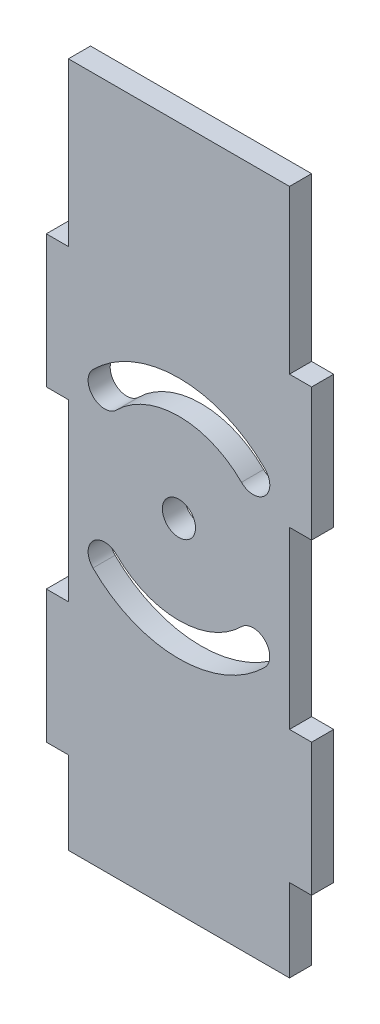
ISO-10303-21;
HEADER;
FILE_DESCRIPTION(('STEP AP214'),'2;1');
FILE_NAME('part.step','',(''),(''),'','','');
FILE_SCHEMA(('AUTOMOTIVE_DESIGN { 1 0 10303 214 1 1 1 1 }'));
ENDSEC;
DATA;
#1=APPLICATION_CONTEXT('core data for automotive mechanical design processes');
#2=APPLICATION_PROTOCOL_DEFINITION('international standard','automotive_design',2000,#1);
#3=PRODUCT_CONTEXT('',#1,'mechanical');
#4=PRODUCT('Part','Part','',(#3));
#5=PRODUCT_RELATED_PRODUCT_CATEGORY('part','',(#4));
#6=PRODUCT_DEFINITION_FORMATION('','',#4);
#7=PRODUCT_DEFINITION_CONTEXT('part definition',#1,'design');
#8=PRODUCT_DEFINITION('design','',#6,#7);
#9=PRODUCT_DEFINITION_SHAPE('','',#8);
#10=(LENGTH_UNIT() NAMED_UNIT(*) SI_UNIT(.MILLI.,.METRE.));
#11=(NAMED_UNIT(*) PLANE_ANGLE_UNIT() SI_UNIT($,.RADIAN.));
#12=(NAMED_UNIT(*) SI_UNIT($,.STERADIAN.) SOLID_ANGLE_UNIT());
#13=UNCERTAINTY_MEASURE_WITH_UNIT(LENGTH_MEASURE(1.E-05),#10,'distance_accuracy_value','');
#14=(GEOMETRIC_REPRESENTATION_CONTEXT(3) GLOBAL_UNCERTAINTY_ASSIGNED_CONTEXT((#13)) GLOBAL_UNIT_ASSIGNED_CONTEXT((#10,
#11,#12)) REPRESENTATION_CONTEXT('',''));
#15=CARTESIAN_POINT('',(0.,0.,0.));
#16=DIRECTION('',(0.,0.,1.));
#17=DIRECTION('',(1.,0.,0.));
#18=AXIS2_PLACEMENT_3D('',#15,#16,#17);
#19=CARTESIAN_POINT('',(0.,0.,3.175));
#20=DIRECTION('',(0.,0.,-1.));
#21=DIRECTION('',(-1.,0.,0.));
#22=AXIS2_PLACEMENT_3D('',#19,#20,#21);
#23=PLANE('',#22);
#24=CARTESIAN_POINT('',(-19.05,316.548657531254,3.175));
#25=DIRECTION('',(0.,0.,1.));
#26=DIRECTION('',(1.,0.,0.));
#27=AXIS2_PLACEMENT_3D('',#24,#25,#26);
#28=CIRCLE('',#27,2.38125000000001);
#29=CARTESIAN_POINT('',(-16.66875,316.548657531254,3.175));
#30=VERTEX_POINT('',#29);
#31=EDGE_CURVE('E242',#30,#30,#28,.T.);
#32=ORIENTED_EDGE('',*,*,#31,.F.);
#33=EDGE_LOOP('',(#32));
#34=FACE_BOUND('',#33,.T.);
#35=CARTESIAN_POINT('',(-19.05,316.548657531254,3.175));
#36=DIRECTION('',(0.,0.,1.));
#37=DIRECTION('',(1.,0.,0.));
#38=AXIS2_PLACEMENT_3D('',#35,#36,#37);
#39=CIRCLE('',#38,12.7);
#40=CARTESIAN_POINT('',(-28.0302561210692,307.568401410185,3.175));
#41=VERTEX_POINT('',#40);
#42=CARTESIAN_POINT('',(-10.0697438789309,307.568401410185,3.175));
#43=VERTEX_POINT('',#42);
#44=EDGE_CURVE('E255',#41,#43,#39,.T.);
#45=ORIENTED_EDGE('',*,*,#44,.T.);
#46=CARTESIAN_POINT('',(-8.38594585623039,305.884603387485,3.175));
#47=DIRECTION('',(0.,0.,1.));
#48=DIRECTION('',(1.,0.,0.));
#49=AXIS2_PLACEMENT_3D('',#46,#47,#48);
#50=CIRCLE('',#49,2.38125);
#51=CARTESIAN_POINT('',(-6.70214783352994,304.200805364784,3.175));
#52=VERTEX_POINT('',#51);
#53=EDGE_CURVE('E262',#52,#43,#50,.T.);
#54=ORIENTED_EDGE('',*,*,#53,.F.);
#55=CARTESIAN_POINT('',(-19.05,316.548657531254,3.175));
#56=DIRECTION('',(0.,0.,1.));
#57=DIRECTION('',(1.,0.,0.));
#58=AXIS2_PLACEMENT_3D('',#55,#56,#57);
#59=CIRCLE('',#58,17.4625);
#60=CARTESIAN_POINT('',(-31.3978521664701,304.200805364784,3.175));
#61=VERTEX_POINT('',#60);
#62=EDGE_CURVE('E277',#61,#52,#59,.T.);
#63=ORIENTED_EDGE('',*,*,#62,.F.);
#64=CARTESIAN_POINT('',(-29.7140541437696,305.884603387485,3.175));
#65=DIRECTION('',(0.,0.,1.));
#66=DIRECTION('',(1.,0.,0.));
#67=AXIS2_PLACEMENT_3D('',#64,#65,#66);
#68=CIRCLE('',#67,2.38125);
#69=EDGE_CURVE('E274',#41,#61,#68,.T.);
#70=ORIENTED_EDGE('',*,*,#69,.F.);
#71=EDGE_LOOP('',(#45,#54,#63,#70));
#72=FACE_BOUND('',#71,.T.);
#73=DIRECTION('',(0.,-1.,0.));
#74=VECTOR('',#73,1.);
#75=CARTESIAN_POINT('',(-3.17500000000003,365.778475051382,3.175));
#76=LINE('',#75,#74);
#77=CARTESIAN_POINT('',(-3.17500000000003,365.778475051382,3.175));
#78=VERTEX_POINT('',#77);
#79=CARTESIAN_POINT('',(-3.17500000000003,342.42138650204,3.175));
#80=VERTEX_POINT('',#79);
#81=EDGE_CURVE('E291',#78,#80,#76,.T.);
#82=ORIENTED_EDGE('',*,*,#81,.F.);
#83=DIRECTION('',(-1.,0.,0.));
#84=VECTOR('',#83,1.);
#85=CARTESIAN_POINT('',(-3.17500000000003,365.778475051382,3.175));
#86=LINE('',#85,#84);
#87=CARTESIAN_POINT('',(-34.925,365.778475051382,3.175));
#88=VERTEX_POINT('',#87);
#89=EDGE_CURVE('E340',#78,#88,#86,.T.);
#90=ORIENTED_EDGE('',*,*,#89,.T.);
#91=DIRECTION('',(0.,-1.,0.));
#92=VECTOR('',#91,1.);
#93=CARTESIAN_POINT('',(-34.925,365.778475051382,3.175));
#94=LINE('',#93,#92);
#95=CARTESIAN_POINT('',(-34.925,342.42138650204,3.175));
#96=VERTEX_POINT('',#95);
#97=EDGE_CURVE('E338',#88,#96,#94,.T.);
#98=ORIENTED_EDGE('',*,*,#97,.T.);
#99=DIRECTION('',(1.,0.,0.));
#100=VECTOR('',#99,1.);
#101=CARTESIAN_POINT('',(-38.1,342.42138650204,3.175));
#102=LINE('',#101,#100);
#103=CARTESIAN_POINT('',(-38.1,342.42138650204,3.175));
#104=VERTEX_POINT('',#103);
#105=EDGE_CURVE('E335',#104,#96,#102,.T.);
#106=ORIENTED_EDGE('',*,*,#105,.F.);
#107=DIRECTION('',(0.,-1.,0.));
#108=VECTOR('',#107,1.);
#109=CARTESIAN_POINT('',(-38.1,342.42138650204,3.175));
#110=LINE('',#109,#108);
#111=CARTESIAN_POINT('',(-38.1,323.37138650204,3.175));
#112=VERTEX_POINT('',#111);
#113=EDGE_CURVE('E333',#104,#112,#110,.T.);
#114=ORIENTED_EDGE('',*,*,#113,.T.);
#115=DIRECTION('',(1.,0.,0.));
#116=VECTOR('',#115,1.);
#117=CARTESIAN_POINT('',(-38.1,323.37138650204,3.175));
#118=LINE('',#117,#116);
#119=CARTESIAN_POINT('',(-34.925,323.37138650204,3.175));
#120=VERTEX_POINT('',#119);
#121=EDGE_CURVE('E331',#112,#120,#118,.T.);
#122=ORIENTED_EDGE('',*,*,#121,.T.);
#123=DIRECTION('',(0.,-1.,0.));
#124=VECTOR('',#123,1.);
#125=CARTESIAN_POINT('',(-34.925,323.37138650204,3.175));
#126=LINE('',#125,#124);
#127=CARTESIAN_POINT('',(-34.925,298.240631324578,3.175));
#128=VERTEX_POINT('',#127);
#129=EDGE_CURVE('E329',#120,#128,#126,.T.);
#130=ORIENTED_EDGE('',*,*,#129,.T.);
#131=DIRECTION('',(1.,0.,0.));
#132=VECTOR('',#131,1.);
#133=CARTESIAN_POINT('',(-38.1,298.240631324578,3.175));
#134=LINE('',#133,#132);
#135=CARTESIAN_POINT('',(-38.1,298.240631324578,3.175));
#136=VERTEX_POINT('',#135);
#137=EDGE_CURVE('E326',#136,#128,#134,.T.);
#138=ORIENTED_EDGE('',*,*,#137,.F.);
#139=DIRECTION('',(0.,-1.,0.));
#140=VECTOR('',#139,1.);
#141=CARTESIAN_POINT('',(-38.1,298.240631324578,3.175));
#142=LINE('',#141,#140);
#143=CARTESIAN_POINT('',(-38.1,279.190631324578,3.175));
#144=VERTEX_POINT('',#143);
#145=EDGE_CURVE('E324',#136,#144,#142,.T.);
#146=ORIENTED_EDGE('',*,*,#145,.T.);
#147=DIRECTION('',(1.,0.,0.));
#148=VECTOR('',#147,1.);
#149=CARTESIAN_POINT('',(-38.1,279.190631324578,3.175));
#150=LINE('',#149,#148);
#151=CARTESIAN_POINT('',(-34.925,279.190631324578,3.175));
#152=VERTEX_POINT('',#151);
#153=EDGE_CURVE('E322',#144,#152,#150,.T.);
#154=ORIENTED_EDGE('',*,*,#153,.T.);
#155=DIRECTION('',(0.,-1.,0.));
#156=VECTOR('',#155,1.);
#157=CARTESIAN_POINT('',(-34.925,279.190631324578,3.175));
#158=LINE('',#157,#156);
#159=CARTESIAN_POINT('',(-34.925,267.318840011126,3.175));
#160=VERTEX_POINT('',#159);
#161=EDGE_CURVE('E320',#152,#160,#158,.T.);
#162=ORIENTED_EDGE('',*,*,#161,.T.);
#163=DIRECTION('',(-1.,0.,0.));
#164=VECTOR('',#163,1.);
#165=CARTESIAN_POINT('',(-3.17500000000003,267.318840011126,3.175));
#166=LINE('',#165,#164);
#167=CARTESIAN_POINT('',(-3.17500000000003,267.318840011126,3.175));
#168=VERTEX_POINT('',#167);
#169=EDGE_CURVE('E317',#168,#160,#166,.T.);
#170=ORIENTED_EDGE('',*,*,#169,.F.);
#171=DIRECTION('',(0.,-1.,0.));
#172=VECTOR('',#171,1.);
#173=CARTESIAN_POINT('',(-3.17500000000003,279.190631324578,3.175));
#174=LINE('',#173,#172);
#175=CARTESIAN_POINT('',(-3.17500000000003,279.190631324578,3.175));
#176=VERTEX_POINT('',#175);
#177=EDGE_CURVE('E314',#176,#168,#174,.T.);
#178=ORIENTED_EDGE('',*,*,#177,.F.);
#179=DIRECTION('',(-1.,0.,0.));
#180=VECTOR('',#179,1.);
#181=CARTESIAN_POINT('',(0.,279.190631324578,3.175));
#182=LINE('',#181,#180);
#183=CARTESIAN_POINT('',(0.,279.190631324578,3.175));
#184=VERTEX_POINT('',#183);
#185=EDGE_CURVE('E311',#184,#176,#182,.T.);
#186=ORIENTED_EDGE('',*,*,#185,.F.);
#187=DIRECTION('',(0.,-1.,0.));
#188=VECTOR('',#187,1.);
#189=CARTESIAN_POINT('',(0.,298.240631324578,3.175));
#190=LINE('',#189,#188);
#191=CARTESIAN_POINT('',(0.,298.240631324578,3.175));
#192=VERTEX_POINT('',#191);
#193=EDGE_CURVE('E308',#192,#184,#190,.T.);
#194=ORIENTED_EDGE('',*,*,#193,.F.);
#195=DIRECTION('',(-1.,0.,0.));
#196=VECTOR('',#195,1.);
#197=CARTESIAN_POINT('',(0.,298.240631324578,3.175));
#198=LINE('',#197,#196);
#199=CARTESIAN_POINT('',(-3.17500000000003,298.240631324578,3.175));
#200=VERTEX_POINT('',#199);
#201=EDGE_CURVE('E306',#192,#200,#198,.T.);
#202=ORIENTED_EDGE('',*,*,#201,.T.);
#203=DIRECTION('',(0.,-1.,0.));
#204=VECTOR('',#203,1.);
#205=CARTESIAN_POINT('',(-3.17500000000003,323.37138650204,3.175));
#206=LINE('',#205,#204);
#207=CARTESIAN_POINT('',(-3.17500000000003,323.37138650204,3.175));
#208=VERTEX_POINT('',#207);
#209=EDGE_CURVE('E303',#208,#200,#206,.T.);
#210=ORIENTED_EDGE('',*,*,#209,.F.);
#211=DIRECTION('',(-1.,0.,0.));
#212=VECTOR('',#211,1.);
#213=CARTESIAN_POINT('',(0.,323.37138650204,3.175));
#214=LINE('',#213,#212);
#215=CARTESIAN_POINT('',(0.,323.37138650204,3.175));
#216=VERTEX_POINT('',#215);
#217=EDGE_CURVE('E300',#216,#208,#214,.T.);
#218=ORIENTED_EDGE('',*,*,#217,.F.);
#219=DIRECTION('',(0.,-1.,0.));
#220=VECTOR('',#219,1.);
#221=CARTESIAN_POINT('',(0.,342.42138650204,3.175));
#222=LINE('',#221,#220);
#223=CARTESIAN_POINT('',(0.,342.42138650204,3.175));
#224=VERTEX_POINT('',#223);
#225=EDGE_CURVE('E297',#224,#216,#222,.T.);
#226=ORIENTED_EDGE('',*,*,#225,.F.);
#227=DIRECTION('',(-1.,0.,0.));
#228=VECTOR('',#227,1.);
#229=CARTESIAN_POINT('',(0.,342.42138650204,3.175));
#230=LINE('',#229,#228);
#231=EDGE_CURVE('E294',#224,#80,#230,.T.);
#232=ORIENTED_EDGE('',*,*,#231,.T.);
#233=EDGE_LOOP('',(#82,#90,#98,#106,#114,#122,#130,#138,#146,#154,#162,#170,#178,#186,#194,#202,
#210,#218,#226,#232));
#234=FACE_BOUND('',#233,.T.);
#235=CARTESIAN_POINT('',(-19.05,316.548657531254,3.175));
#236=DIRECTION('',(0.,0.,1.));
#237=DIRECTION('',(1.,0.,0.));
#238=AXIS2_PLACEMENT_3D('',#235,#236,#237);
#239=CIRCLE('',#238,12.7024091767679);
#240=CARTESIAN_POINT('',(-10.0680403337012,325.530617197553,3.175));
#241=VERTEX_POINT('',#240);
#242=CARTESIAN_POINT('',(-28.0319596662989,325.530617197553,3.175));
#243=VERTEX_POINT('',#242);
#244=EDGE_CURVE('E50',#241,#243,#239,.T.);
#245=ORIENTED_EDGE('',*,*,#244,.T.);
#246=CARTESIAN_POINT('',(-29.7157576889994,327.214415220254,3.175));
#247=DIRECTION('',(0.,0.,1.));
#248=DIRECTION('',(1.,0.,0.));
#249=AXIS2_PLACEMENT_3D('',#246,#247,#248);
#250=CIRCLE('',#249,2.38125000000002);
#251=CARTESIAN_POINT('',(-31.3995557116998,328.898213242954,3.175));
#252=VERTEX_POINT('',#251);
#253=EDGE_CURVE('E236',#252,#243,#250,.T.);
#254=ORIENTED_EDGE('',*,*,#253,.F.);
#255=CARTESIAN_POINT('',(-19.05,316.548657531254,3.175));
#256=DIRECTION('',(0.,0.,1.));
#257=DIRECTION('',(1.,0.,0.));
#258=AXIS2_PLACEMENT_3D('',#255,#256,#257);
#259=CIRCLE('',#258,17.464909176768);
#260=CARTESIAN_POINT('',(-6.70044428830035,328.898213242954,3.175));
#261=VERTEX_POINT('',#260);
#262=EDGE_CURVE('E239',#261,#252,#259,.T.);
#263=ORIENTED_EDGE('',*,*,#262,.F.);
#264=CARTESIAN_POINT('',(-8.38424231100077,327.214415220254,3.175));
#265=DIRECTION('',(0.,0.,1.));
#266=DIRECTION('',(1.,0.,0.));
#267=AXIS2_PLACEMENT_3D('',#264,#265,#266);
#268=CIRCLE('',#267,2.38124999999999);
#269=EDGE_CURVE('E248',#241,#261,#268,.T.);
#270=ORIENTED_EDGE('',*,*,#269,.F.);
#271=EDGE_LOOP('',(#245,#254,#263,#270));
#272=FACE_BOUND('',#271,.T.);
#273=ADVANCED_FACE('F33',(#34,#72,#234,#272),#23,.F.);
#274=CARTESIAN_POINT('',(0.,0.,0.));
#275=DIRECTION('',(0.,0.,-1.));
#276=DIRECTION('',(-1.,0.,0.));
#277=AXIS2_PLACEMENT_3D('',#274,#275,#276);
#278=PLANE('',#277);
#279=CARTESIAN_POINT('',(-19.05,316.548657531254,0.));
#280=DIRECTION('',(0.,0.,1.));
#281=DIRECTION('',(1.,0.,0.));
#282=AXIS2_PLACEMENT_3D('',#279,#280,#281);
#283=CIRCLE('',#282,2.38125000000001);
#284=CARTESIAN_POINT('',(-16.66875,316.548657531254,0.));
#285=VERTEX_POINT('',#284);
#286=EDGE_CURVE('E249',#285,#285,#283,.T.);
#287=ORIENTED_EDGE('',*,*,#286,.T.);
#288=EDGE_LOOP('',(#287));
#289=FACE_BOUND('',#288,.T.);
#290=DIRECTION('',(0.,-1.,0.));
#291=VECTOR('',#290,1.);
#292=CARTESIAN_POINT('',(-3.17500000000003,365.778475051382,0.));
#293=LINE('',#292,#291);
#294=CARTESIAN_POINT('',(-3.17500000000003,365.778475051382,0.));
#295=VERTEX_POINT('',#294);
#296=CARTESIAN_POINT('',(-3.17500000000003,342.42138650204,0.));
#297=VERTEX_POINT('',#296);
#298=EDGE_CURVE('E284',#295,#297,#293,.T.);
#299=ORIENTED_EDGE('',*,*,#298,.T.);
#300=DIRECTION('',(-1.,0.,0.));
#301=VECTOR('',#300,1.);
#302=CARTESIAN_POINT('',(0.,342.42138650204,0.));
#303=LINE('',#302,#301);
#304=CARTESIAN_POINT('',(0.,342.42138650204,0.));
#305=VERTEX_POINT('',#304);
#306=EDGE_CURVE('E344',#305,#297,#303,.T.);
#307=ORIENTED_EDGE('',*,*,#306,.F.);
#308=DIRECTION('',(0.,-1.,0.));
#309=VECTOR('',#308,1.);
#310=CARTESIAN_POINT('',(0.,342.42138650204,0.));
#311=LINE('',#310,#309);
#312=CARTESIAN_POINT('',(0.,323.37138650204,0.));
#313=VERTEX_POINT('',#312);
#314=EDGE_CURVE('E347',#305,#313,#311,.T.);
#315=ORIENTED_EDGE('',*,*,#314,.T.);
#316=DIRECTION('',(-1.,0.,0.));
#317=VECTOR('',#316,1.);
#318=CARTESIAN_POINT('',(0.,323.37138650204,0.));
#319=LINE('',#318,#317);
#320=CARTESIAN_POINT('',(-3.17500000000003,323.37138650204,0.));
#321=VERTEX_POINT('',#320);
#322=EDGE_CURVE('E350',#313,#321,#319,.T.);
#323=ORIENTED_EDGE('',*,*,#322,.T.);
#324=DIRECTION('',(0.,-1.,0.));
#325=VECTOR('',#324,1.);
#326=CARTESIAN_POINT('',(-3.17500000000003,323.37138650204,0.));
#327=LINE('',#326,#325);
#328=CARTESIAN_POINT('',(-3.17500000000003,298.240631324578,0.));
#329=VERTEX_POINT('',#328);
#330=EDGE_CURVE('E353',#321,#329,#327,.T.);
#331=ORIENTED_EDGE('',*,*,#330,.T.);
#332=DIRECTION('',(-1.,0.,0.));
#333=VECTOR('',#332,1.);
#334=CARTESIAN_POINT('',(0.,298.240631324578,0.));
#335=LINE('',#334,#333);
#336=CARTESIAN_POINT('',(0.,298.240631324578,0.));
#337=VERTEX_POINT('',#336);
#338=EDGE_CURVE('E356',#337,#329,#335,.T.);
#339=ORIENTED_EDGE('',*,*,#338,.F.);
#340=DIRECTION('',(0.,-1.,0.));
#341=VECTOR('',#340,1.);
#342=CARTESIAN_POINT('',(0.,298.240631324578,0.));
#343=LINE('',#342,#341);
#344=CARTESIAN_POINT('',(0.,279.190631324578,0.));
#345=VERTEX_POINT('',#344);
#346=EDGE_CURVE('E359',#337,#345,#343,.T.);
#347=ORIENTED_EDGE('',*,*,#346,.T.);
#348=DIRECTION('',(-1.,0.,0.));
#349=VECTOR('',#348,1.);
#350=CARTESIAN_POINT('',(0.,279.190631324578,0.));
#351=LINE('',#350,#349);
#352=CARTESIAN_POINT('',(-3.17500000000003,279.190631324578,0.));
#353=VERTEX_POINT('',#352);
#354=EDGE_CURVE('E362',#345,#353,#351,.T.);
#355=ORIENTED_EDGE('',*,*,#354,.T.);
#356=DIRECTION('',(0.,-1.,0.));
#357=VECTOR('',#356,1.);
#358=CARTESIAN_POINT('',(-3.17500000000003,279.190631324578,0.));
#359=LINE('',#358,#357);
#360=CARTESIAN_POINT('',(-3.17500000000003,267.318840011126,0.));
#361=VERTEX_POINT('',#360);
#362=EDGE_CURVE('E365',#353,#361,#359,.T.);
#363=ORIENTED_EDGE('',*,*,#362,.T.);
#364=DIRECTION('',(-1.,0.,0.));
#365=VECTOR('',#364,1.);
#366=CARTESIAN_POINT('',(-3.17500000000003,267.318840011126,0.));
#367=LINE('',#366,#365);
#368=CARTESIAN_POINT('',(-34.925,267.318840011126,0.));
#369=VERTEX_POINT('',#368);
#370=EDGE_CURVE('E368',#361,#369,#367,.T.);
#371=ORIENTED_EDGE('',*,*,#370,.T.);
#372=DIRECTION('',(0.,-1.,0.));
#373=VECTOR('',#372,1.);
#374=CARTESIAN_POINT('',(-34.925,279.190631324578,0.));
#375=LINE('',#374,#373);
#376=CARTESIAN_POINT('',(-34.925,279.190631324578,0.));
#377=VERTEX_POINT('',#376);
#378=EDGE_CURVE('E371',#377,#369,#375,.T.);
#379=ORIENTED_EDGE('',*,*,#378,.F.);
#380=DIRECTION('',(1.,0.,0.));
#381=VECTOR('',#380,1.);
#382=CARTESIAN_POINT('',(-38.1,279.190631324578,0.));
#383=LINE('',#382,#381);
#384=CARTESIAN_POINT('',(-38.1,279.190631324578,0.));
#385=VERTEX_POINT('',#384);
#386=EDGE_CURVE('E374',#385,#377,#383,.T.);
#387=ORIENTED_EDGE('',*,*,#386,.F.);
#388=DIRECTION('',(0.,-1.,0.));
#389=VECTOR('',#388,1.);
#390=CARTESIAN_POINT('',(-38.1,298.240631324578,0.));
#391=LINE('',#390,#389);
#392=CARTESIAN_POINT('',(-38.1,298.240631324578,0.));
#393=VERTEX_POINT('',#392);
#394=EDGE_CURVE('E376',#393,#385,#391,.T.);
#395=ORIENTED_EDGE('',*,*,#394,.F.);
#396=DIRECTION('',(1.,0.,0.));
#397=VECTOR('',#396,1.);
#398=CARTESIAN_POINT('',(-38.1,298.240631324578,0.));
#399=LINE('',#398,#397);
#400=CARTESIAN_POINT('',(-34.925,298.240631324578,0.));
#401=VERTEX_POINT('',#400);
#402=EDGE_CURVE('E378',#393,#401,#399,.T.);
#403=ORIENTED_EDGE('',*,*,#402,.T.);
#404=DIRECTION('',(0.,-1.,0.));
#405=VECTOR('',#404,1.);
#406=CARTESIAN_POINT('',(-34.925,323.37138650204,0.));
#407=LINE('',#406,#405);
#408=CARTESIAN_POINT('',(-34.925,323.37138650204,0.));
#409=VERTEX_POINT('',#408);
#410=EDGE_CURVE('E381',#409,#401,#407,.T.);
#411=ORIENTED_EDGE('',*,*,#410,.F.);
#412=DIRECTION('',(1.,0.,0.));
#413=VECTOR('',#412,1.);
#414=CARTESIAN_POINT('',(-38.1,323.37138650204,0.));
#415=LINE('',#414,#413);
#416=CARTESIAN_POINT('',(-38.1,323.37138650204,0.));
#417=VERTEX_POINT('',#416);
#418=EDGE_CURVE('E384',#417,#409,#415,.T.);
#419=ORIENTED_EDGE('',*,*,#418,.F.);
#420=DIRECTION('',(0.,-1.,0.));
#421=VECTOR('',#420,1.);
#422=CARTESIAN_POINT('',(-38.1,342.42138650204,0.));
#423=LINE('',#422,#421);
#424=CARTESIAN_POINT('',(-38.1,342.42138650204,0.));
#425=VERTEX_POINT('',#424);
#426=EDGE_CURVE('E386',#425,#417,#423,.T.);
#427=ORIENTED_EDGE('',*,*,#426,.F.);
#428=DIRECTION('',(1.,0.,0.));
#429=VECTOR('',#428,1.);
#430=CARTESIAN_POINT('',(-38.1,342.42138650204,0.));
#431=LINE('',#430,#429);
#432=CARTESIAN_POINT('',(-34.925,342.42138650204,0.));
#433=VERTEX_POINT('',#432);
#434=EDGE_CURVE('E388',#425,#433,#431,.T.);
#435=ORIENTED_EDGE('',*,*,#434,.T.);
#436=DIRECTION('',(0.,-1.,0.));
#437=VECTOR('',#436,1.);
#438=CARTESIAN_POINT('',(-34.925,365.778475051382,0.));
#439=LINE('',#438,#437);
#440=CARTESIAN_POINT('',(-34.925,365.778475051382,0.));
#441=VERTEX_POINT('',#440);
#442=EDGE_CURVE('E391',#441,#433,#439,.T.);
#443=ORIENTED_EDGE('',*,*,#442,.F.);
#444=DIRECTION('',(-1.,0.,0.));
#445=VECTOR('',#444,1.);
#446=CARTESIAN_POINT('',(-3.17500000000003,365.778475051382,0.));
#447=LINE('',#446,#445);
#448=EDGE_CURVE('E295',#295,#441,#447,.T.);
#449=ORIENTED_EDGE('',*,*,#448,.F.);
#450=EDGE_LOOP('',(#299,#307,#315,#323,#331,#339,#347,#355,#363,#371,#379,#387,#395,#403,#411,
#419,#427,#435,#443,#449));
#451=FACE_BOUND('',#450,.T.);
#452=CARTESIAN_POINT('',(-8.38594585623039,305.884603387485,0.));
#453=DIRECTION('',(0.,0.,1.));
#454=DIRECTION('',(1.,0.,0.));
#455=AXIS2_PLACEMENT_3D('',#452,#453,#454);
#456=CIRCLE('',#455,2.38125);
#457=CARTESIAN_POINT('',(-6.70214783352994,304.200805364784,0.));
#458=VERTEX_POINT('',#457);
#459=CARTESIAN_POINT('',(-10.0697438789309,307.568401410185,0.));
#460=VERTEX_POINT('',#459);
#461=EDGE_CURVE('E268',#458,#460,#456,.T.);
#462=ORIENTED_EDGE('',*,*,#461,.T.);
#463=CARTESIAN_POINT('',(-19.05,316.548657531254,0.));
#464=DIRECTION('',(0.,0.,1.));
#465=DIRECTION('',(1.,0.,0.));
#466=AXIS2_PLACEMENT_3D('',#463,#464,#465);
#467=CIRCLE('',#466,12.7);
#468=CARTESIAN_POINT('',(-28.0302561210692,307.568401410185,0.));
#469=VERTEX_POINT('',#468);
#470=EDGE_CURVE('E259',#469,#460,#467,.T.);
#471=ORIENTED_EDGE('',*,*,#470,.F.);
#472=CARTESIAN_POINT('',(-29.7140541437696,305.884603387485,0.));
#473=DIRECTION('',(0.,0.,1.));
#474=DIRECTION('',(1.,0.,0.));
#475=AXIS2_PLACEMENT_3D('',#472,#473,#474);
#476=CIRCLE('',#475,2.38125);
#477=CARTESIAN_POINT('',(-31.3978521664701,304.200805364784,0.));
#478=VERTEX_POINT('',#477);
#479=EDGE_CURVE('E261',#469,#478,#476,.T.);
#480=ORIENTED_EDGE('',*,*,#479,.T.);
#481=CARTESIAN_POINT('',(-19.05,316.548657531254,0.));
#482=DIRECTION('',(0.,0.,1.));
#483=DIRECTION('',(1.,0.,0.));
#484=AXIS2_PLACEMENT_3D('',#481,#482,#483);
#485=CIRCLE('',#484,17.4625);
#486=EDGE_CURVE('E265',#478,#458,#485,.T.);
#487=ORIENTED_EDGE('',*,*,#486,.T.);
#488=EDGE_LOOP('',(#462,#471,#480,#487));
#489=FACE_BOUND('',#488,.T.);
#490=CARTESIAN_POINT('',(-29.7157576889994,327.214415220254,0.));
#491=DIRECTION('',(0.,0.,1.));
#492=DIRECTION('',(1.,0.,0.));
#493=AXIS2_PLACEMENT_3D('',#490,#491,#492);
#494=CIRCLE('',#493,2.38125000000002);
#495=CARTESIAN_POINT('',(-31.3995557116998,328.898213242954,0.));
#496=VERTEX_POINT('',#495);
#497=CARTESIAN_POINT('',(-28.0319596662989,325.530617197553,0.));
#498=VERTEX_POINT('',#497);
#499=EDGE_CURVE('E226',#496,#498,#494,.T.);
#500=ORIENTED_EDGE('',*,*,#499,.T.);
#501=CARTESIAN_POINT('',(-19.05,316.548657531254,0.));
#502=DIRECTION('',(0.,0.,1.));
#503=DIRECTION('',(1.,0.,0.));
#504=AXIS2_PLACEMENT_3D('',#501,#502,#503);
#505=CIRCLE('',#504,12.7024091767679);
#506=CARTESIAN_POINT('',(-10.0680403337012,325.530617197553,0.));
#507=VERTEX_POINT('',#506);
#508=EDGE_CURVE('E220',#507,#498,#505,.T.);
#509=ORIENTED_EDGE('',*,*,#508,.F.);
#510=CARTESIAN_POINT('',(-8.38424231100077,327.214415220254,0.));
#511=DIRECTION('',(0.,0.,1.));
#512=DIRECTION('',(1.,0.,0.));
#513=AXIS2_PLACEMENT_3D('',#510,#511,#512);
#514=CIRCLE('',#513,2.38124999999999);
#515=CARTESIAN_POINT('',(-6.70044428830033,328.898213242954,0.));
#516=VERTEX_POINT('',#515);
#517=EDGE_CURVE('E229',#507,#516,#514,.T.);
#518=ORIENTED_EDGE('',*,*,#517,.T.);
#519=CARTESIAN_POINT('',(-19.05,316.548657531254,0.));
#520=DIRECTION('',(0.,0.,1.));
#521=DIRECTION('',(1.,0.,0.));
#522=AXIS2_PLACEMENT_3D('',#519,#520,#521);
#523=CIRCLE('',#522,17.464909176768);
#524=EDGE_CURVE('E58',#516,#496,#523,.T.);
#525=ORIENTED_EDGE('',*,*,#524,.T.);
#526=EDGE_LOOP('',(#500,#509,#518,#525));
#527=FACE_BOUND('',#526,.T.);
#528=ADVANCED_FACE('F234',(#289,#451,#489,#527),#278,.T.);
#529=CARTESIAN_POINT('',(-3.17500000000003,365.778475051382,3.175));
#530=DIRECTION('',(1.,0.,0.));
#531=DIRECTION('',(0.,0.,-1.));
#532=AXIS2_PLACEMENT_3D('',#529,#530,#531);
#533=PLANE('',#532);
#534=ORIENTED_EDGE('',*,*,#298,.F.);
#535=DIRECTION('',(0.,0.,-1.));
#536=VECTOR('',#535,1.);
#537=CARTESIAN_POINT('',(-3.17500000000003,365.778475051382,3.175));
#538=LINE('',#537,#536);
#539=EDGE_CURVE('E11',#78,#295,#538,.T.);
#540=ORIENTED_EDGE('',*,*,#539,.F.);
#541=ORIENTED_EDGE('',*,*,#81,.T.);
#542=DIRECTION('',(0.,0.,-1.));
#543=VECTOR('',#542,1.);
#544=CARTESIAN_POINT('',(-3.17500000000003,342.42138650204,3.175));
#545=LINE('',#544,#543);
#546=EDGE_CURVE('E37',#80,#297,#545,.T.);
#547=ORIENTED_EDGE('',*,*,#546,.T.);
#548=EDGE_LOOP('',(#534,#540,#541,#547));
#549=FACE_BOUND('',#548,.T.);
#550=ADVANCED_FACE('F35',(#549),#533,.T.);
#551=CARTESIAN_POINT('',(-3.17500000000003,365.778475051382,3.175));
#552=DIRECTION('',(0.,-1.,0.));
#553=DIRECTION('',(0.,0.,-1.));
#554=AXIS2_PLACEMENT_3D('',#551,#552,#553);
#555=PLANE('',#554);
#556=ORIENTED_EDGE('',*,*,#448,.T.);
#557=DIRECTION('',(0.,0.,-1.));
#558=VECTOR('',#557,1.);
#559=CARTESIAN_POINT('',(-34.925,365.778475051382,3.175));
#560=LINE('',#559,#558);
#561=EDGE_CURVE('E42',#88,#441,#560,.T.);
#562=ORIENTED_EDGE('',*,*,#561,.F.);
#563=ORIENTED_EDGE('',*,*,#89,.F.);
#564=ORIENTED_EDGE('',*,*,#539,.T.);
#565=EDGE_LOOP('',(#556,#562,#563,#564));
#566=FACE_BOUND('',#565,.T.);
#567=ADVANCED_FACE('F448',(#566),#555,.F.);
#568=CARTESIAN_POINT('',(-34.925,365.778475051382,3.175));
#569=DIRECTION('',(1.,0.,0.));
#570=DIRECTION('',(0.,0.,-1.));
#571=AXIS2_PLACEMENT_3D('',#568,#569,#570);
#572=PLANE('',#571);
#573=ORIENTED_EDGE('',*,*,#442,.T.);
#574=DIRECTION('',(0.,0.,-1.));
#575=VECTOR('',#574,1.);
#576=CARTESIAN_POINT('',(-34.925,342.42138650204,3.175));
#577=LINE('',#576,#575);
#578=EDGE_CURVE('E397',#96,#433,#577,.T.);
#579=ORIENTED_EDGE('',*,*,#578,.F.);
#580=ORIENTED_EDGE('',*,*,#97,.F.);
#581=ORIENTED_EDGE('',*,*,#561,.T.);
#582=EDGE_LOOP('',(#573,#579,#580,#581));
#583=FACE_BOUND('',#582,.T.);
#584=ADVANCED_FACE('F452',(#583),#572,.F.);
#585=CARTESIAN_POINT('',(-38.1,342.42138650204,3.175));
#586=DIRECTION('',(0.,1.,0.));
#587=DIRECTION('',(0.,0.,1.));
#588=AXIS2_PLACEMENT_3D('',#585,#586,#587);
#589=PLANE('',#588);
#590=ORIENTED_EDGE('',*,*,#434,.F.);
#591=DIRECTION('',(0.,0.,-1.));
#592=VECTOR('',#591,1.);
#593=CARTESIAN_POINT('',(-38.1,342.42138650204,3.175));
#594=LINE('',#593,#592);
#595=EDGE_CURVE('E399',#104,#425,#594,.T.);
#596=ORIENTED_EDGE('',*,*,#595,.F.);
#597=ORIENTED_EDGE('',*,*,#105,.T.);
#598=ORIENTED_EDGE('',*,*,#578,.T.);
#599=EDGE_LOOP('',(#590,#596,#597,#598));
#600=FACE_BOUND('',#599,.T.);
#601=ADVANCED_FACE('F525',(#600),#589,.T.);
#602=CARTESIAN_POINT('',(-38.1,342.42138650204,3.175));
#603=DIRECTION('',(1.,0.,0.));
#604=DIRECTION('',(0.,0.,-1.));
#605=AXIS2_PLACEMENT_3D('',#602,#603,#604);
#606=PLANE('',#605);
#607=ORIENTED_EDGE('',*,*,#426,.T.);
#608=DIRECTION('',(0.,0.,-1.));
#609=VECTOR('',#608,1.);
#610=CARTESIAN_POINT('',(-38.1,323.37138650204,3.175));
#611=LINE('',#610,#609);
#612=EDGE_CURVE('E401',#112,#417,#611,.T.);
#613=ORIENTED_EDGE('',*,*,#612,.F.);
#614=ORIENTED_EDGE('',*,*,#113,.F.);
#615=ORIENTED_EDGE('',*,*,#595,.T.);
#616=EDGE_LOOP('',(#607,#613,#614,#615));
#617=FACE_BOUND('',#616,.T.);
#618=ADVANCED_FACE('F522',(#617),#606,.F.);
#619=CARTESIAN_POINT('',(-38.1,323.37138650204,3.175));
#620=DIRECTION('',(0.,1.,0.));
#621=DIRECTION('',(0.,0.,1.));
#622=AXIS2_PLACEMENT_3D('',#619,#620,#621);
#623=PLANE('',#622);
#624=ORIENTED_EDGE('',*,*,#418,.T.);
#625=DIRECTION('',(0.,0.,-1.));
#626=VECTOR('',#625,1.);
#627=CARTESIAN_POINT('',(-34.925,323.37138650204,3.175));
#628=LINE('',#627,#626);
#629=EDGE_CURVE('E404',#120,#409,#628,.T.);
#630=ORIENTED_EDGE('',*,*,#629,.F.);
#631=ORIENTED_EDGE('',*,*,#121,.F.);
#632=ORIENTED_EDGE('',*,*,#612,.T.);
#633=EDGE_LOOP('',(#624,#630,#631,#632));
#634=FACE_BOUND('',#633,.T.);
#635=ADVANCED_FACE('F518',(#634),#623,.F.);
#636=CARTESIAN_POINT('',(-34.925,323.37138650204,3.175));
#637=DIRECTION('',(1.,0.,0.));
#638=DIRECTION('',(0.,0.,-1.));
#639=AXIS2_PLACEMENT_3D('',#636,#637,#638);
#640=PLANE('',#639);
#641=ORIENTED_EDGE('',*,*,#410,.T.);
#642=DIRECTION('',(0.,0.,-1.));
#643=VECTOR('',#642,1.);
#644=CARTESIAN_POINT('',(-34.925,298.240631324578,3.175));
#645=LINE('',#644,#643);
#646=EDGE_CURVE('E407',#128,#401,#645,.T.);
#647=ORIENTED_EDGE('',*,*,#646,.F.);
#648=ORIENTED_EDGE('',*,*,#129,.F.);
#649=ORIENTED_EDGE('',*,*,#629,.T.);
#650=EDGE_LOOP('',(#641,#647,#648,#649));
#651=FACE_BOUND('',#650,.T.);
#652=ADVANCED_FACE('F513',(#651),#640,.F.);
#653=CARTESIAN_POINT('',(-38.1,298.240631324578,3.175));
#654=DIRECTION('',(0.,1.,0.));
#655=DIRECTION('',(0.,0.,1.));
#656=AXIS2_PLACEMENT_3D('',#653,#654,#655);
#657=PLANE('',#656);
#658=ORIENTED_EDGE('',*,*,#402,.F.);
#659=DIRECTION('',(0.,0.,-1.));
#660=VECTOR('',#659,1.);
#661=CARTESIAN_POINT('',(-38.1,298.240631324578,3.175));
#662=LINE('',#661,#660);
#663=EDGE_CURVE('E409',#136,#393,#662,.T.);
#664=ORIENTED_EDGE('',*,*,#663,.F.);
#665=ORIENTED_EDGE('',*,*,#137,.T.);
#666=ORIENTED_EDGE('',*,*,#646,.T.);
#667=EDGE_LOOP('',(#658,#664,#665,#666));
#668=FACE_BOUND('',#667,.T.);
#669=ADVANCED_FACE('F507',(#668),#657,.T.);
#670=CARTESIAN_POINT('',(-38.1,298.240631324578,3.175));
#671=DIRECTION('',(1.,0.,0.));
#672=DIRECTION('',(0.,0.,-1.));
#673=AXIS2_PLACEMENT_3D('',#670,#671,#672);
#674=PLANE('',#673);
#675=ORIENTED_EDGE('',*,*,#394,.T.);
#676=DIRECTION('',(0.,0.,-1.));
#677=VECTOR('',#676,1.);
#678=CARTESIAN_POINT('',(-38.1,279.190631324578,3.175));
#679=LINE('',#678,#677);
#680=EDGE_CURVE('E411',#144,#385,#679,.T.);
#681=ORIENTED_EDGE('',*,*,#680,.F.);
#682=ORIENTED_EDGE('',*,*,#145,.F.);
#683=ORIENTED_EDGE('',*,*,#663,.T.);
#684=EDGE_LOOP('',(#675,#681,#682,#683));
#685=FACE_BOUND('',#684,.T.);
#686=ADVANCED_FACE('F504',(#685),#674,.F.);
#687=CARTESIAN_POINT('',(-38.1,279.190631324578,3.175));
#688=DIRECTION('',(0.,1.,0.));
#689=DIRECTION('',(-1.,0.,0.));
#690=AXIS2_PLACEMENT_3D('',#687,#688,#689);
#691=PLANE('',#690);
#692=ORIENTED_EDGE('',*,*,#386,.T.);
#693=DIRECTION('',(0.,0.,-1.));
#694=VECTOR('',#693,1.);
#695=CARTESIAN_POINT('',(-34.925,279.190631324578,3.175));
#696=LINE('',#695,#694);
#697=EDGE_CURVE('E414',#152,#377,#696,.T.);
#698=ORIENTED_EDGE('',*,*,#697,.F.);
#699=ORIENTED_EDGE('',*,*,#153,.F.);
#700=ORIENTED_EDGE('',*,*,#680,.T.);
#701=EDGE_LOOP('',(#692,#698,#699,#700));
#702=FACE_BOUND('',#701,.T.);
#703=ADVANCED_FACE('F499',(#702),#691,.F.);
#704=CARTESIAN_POINT('',(-34.925,279.190631324578,3.175));
#705=DIRECTION('',(1.,0.,0.));
#706=DIRECTION('',(0.,0.,-1.));
#707=AXIS2_PLACEMENT_3D('',#704,#705,#706);
#708=PLANE('',#707);
#709=ORIENTED_EDGE('',*,*,#378,.T.);
#710=DIRECTION('',(0.,0.,-1.));
#711=VECTOR('',#710,1.);
#712=CARTESIAN_POINT('',(-34.925,267.318840011126,3.175));
#713=LINE('',#712,#711);
#714=EDGE_CURVE('E417',#160,#369,#713,.T.);
#715=ORIENTED_EDGE('',*,*,#714,.F.);
#716=ORIENTED_EDGE('',*,*,#161,.F.);
#717=ORIENTED_EDGE('',*,*,#697,.T.);
#718=EDGE_LOOP('',(#709,#715,#716,#717));
#719=FACE_BOUND('',#718,.T.);
#720=ADVANCED_FACE('F493',(#719),#708,.F.);
#721=CARTESIAN_POINT('',(-3.17500000000003,267.318840011126,3.175));
#722=DIRECTION('',(0.,-1.,0.));
#723=DIRECTION('',(0.,0.,-1.));
#724=AXIS2_PLACEMENT_3D('',#721,#722,#723);
#725=PLANE('',#724);
#726=ORIENTED_EDGE('',*,*,#370,.F.);
#727=DIRECTION('',(0.,0.,-1.));
#728=VECTOR('',#727,1.);
#729=CARTESIAN_POINT('',(-3.17500000000003,267.318840011126,3.175));
#730=LINE('',#729,#728);
#731=EDGE_CURVE('E419',#168,#361,#730,.T.);
#732=ORIENTED_EDGE('',*,*,#731,.F.);
#733=ORIENTED_EDGE('',*,*,#169,.T.);
#734=ORIENTED_EDGE('',*,*,#714,.T.);
#735=EDGE_LOOP('',(#726,#732,#733,#734));
#736=FACE_BOUND('',#735,.T.);
#737=ADVANCED_FACE('F489',(#736),#725,.T.);
#738=CARTESIAN_POINT('',(-3.17500000000003,279.190631324578,3.175));
#739=DIRECTION('',(1.,0.,0.));
#740=DIRECTION('',(0.,1.,0.));
#741=AXIS2_PLACEMENT_3D('',#738,#739,#740);
#742=PLANE('',#741);
#743=ORIENTED_EDGE('',*,*,#362,.F.);
#744=DIRECTION('',(0.,0.,-1.));
#745=VECTOR('',#744,1.);
#746=CARTESIAN_POINT('',(-3.17500000000003,279.190631324578,3.175));
#747=LINE('',#746,#745);
#748=EDGE_CURVE('E421',#176,#353,#747,.T.);
#749=ORIENTED_EDGE('',*,*,#748,.F.);
#750=ORIENTED_EDGE('',*,*,#177,.T.);
#751=ORIENTED_EDGE('',*,*,#731,.T.);
#752=EDGE_LOOP('',(#743,#749,#750,#751));
#753=FACE_BOUND('',#752,.T.);
#754=ADVANCED_FACE('F485',(#753),#742,.T.);
#755=CARTESIAN_POINT('',(0.,279.190631324578,3.175));
#756=DIRECTION('',(0.,-1.,0.));
#757=DIRECTION('',(0.,0.,-1.));
#758=AXIS2_PLACEMENT_3D('',#755,#756,#757);
#759=PLANE('',#758);
#760=ORIENTED_EDGE('',*,*,#354,.F.);
#761=DIRECTION('',(0.,0.,-1.));
#762=VECTOR('',#761,1.);
#763=CARTESIAN_POINT('',(0.,279.190631324578,3.175));
#764=LINE('',#763,#762);
#765=EDGE_CURVE('E423',#184,#345,#764,.T.);
#766=ORIENTED_EDGE('',*,*,#765,.F.);
#767=ORIENTED_EDGE('',*,*,#185,.T.);
#768=ORIENTED_EDGE('',*,*,#748,.T.);
#769=EDGE_LOOP('',(#760,#766,#767,#768));
#770=FACE_BOUND('',#769,.T.);
#771=ADVANCED_FACE('F480',(#770),#759,.T.);
#772=CARTESIAN_POINT('',(0.,298.240631324578,3.175));
#773=DIRECTION('',(1.,0.,0.));
#774=DIRECTION('',(0.,0.,-1.));
#775=AXIS2_PLACEMENT_3D('',#772,#773,#774);
#776=PLANE('',#775);
#777=ORIENTED_EDGE('',*,*,#346,.F.);
#778=DIRECTION('',(0.,0.,-1.));
#779=VECTOR('',#778,1.);
#780=CARTESIAN_POINT('',(0.,298.240631324578,3.175));
#781=LINE('',#780,#779);
#782=EDGE_CURVE('E425',#192,#337,#781,.T.);
#783=ORIENTED_EDGE('',*,*,#782,.F.);
#784=ORIENTED_EDGE('',*,*,#193,.T.);
#785=ORIENTED_EDGE('',*,*,#765,.T.);
#786=EDGE_LOOP('',(#777,#783,#784,#785));
#787=FACE_BOUND('',#786,.T.);
#788=ADVANCED_FACE('F475',(#787),#776,.T.);
#789=CARTESIAN_POINT('',(0.,298.240631324578,3.175));
#790=DIRECTION('',(0.,-1.,0.));
#791=DIRECTION('',(0.,0.,-1.));
#792=AXIS2_PLACEMENT_3D('',#789,#790,#791);
#793=PLANE('',#792);
#794=ORIENTED_EDGE('',*,*,#338,.T.);
#795=DIRECTION('',(0.,0.,-1.));
#796=VECTOR('',#795,1.);
#797=CARTESIAN_POINT('',(-3.17500000000003,298.240631324578,3.175));
#798=LINE('',#797,#796);
#799=EDGE_CURVE('E427',#200,#329,#798,.T.);
#800=ORIENTED_EDGE('',*,*,#799,.F.);
#801=ORIENTED_EDGE('',*,*,#201,.F.);
#802=ORIENTED_EDGE('',*,*,#782,.T.);
#803=EDGE_LOOP('',(#794,#800,#801,#802));
#804=FACE_BOUND('',#803,.T.);
#805=ADVANCED_FACE('F472',(#804),#793,.F.);
#806=CARTESIAN_POINT('',(-3.17500000000003,323.37138650204,3.175));
#807=DIRECTION('',(1.,0.,0.));
#808=DIRECTION('',(0.,0.,-1.));
#809=AXIS2_PLACEMENT_3D('',#806,#807,#808);
#810=PLANE('',#809);
#811=ORIENTED_EDGE('',*,*,#330,.F.);
#812=DIRECTION('',(0.,0.,-1.));
#813=VECTOR('',#812,1.);
#814=CARTESIAN_POINT('',(-3.17500000000003,323.37138650204,3.175));
#815=LINE('',#814,#813);
#816=EDGE_CURVE('E429',#208,#321,#815,.T.);
#817=ORIENTED_EDGE('',*,*,#816,.F.);
#818=ORIENTED_EDGE('',*,*,#209,.T.);
#819=ORIENTED_EDGE('',*,*,#799,.T.);
#820=EDGE_LOOP('',(#811,#817,#818,#819));
#821=FACE_BOUND('',#820,.T.);
#822=ADVANCED_FACE('F468',(#821),#810,.T.);
#823=CARTESIAN_POINT('',(0.,323.37138650204,3.175));
#824=DIRECTION('',(0.,-1.,0.));
#825=DIRECTION('',(0.,0.,-1.));
#826=AXIS2_PLACEMENT_3D('',#823,#824,#825);
#827=PLANE('',#826);
#828=ORIENTED_EDGE('',*,*,#322,.F.);
#829=DIRECTION('',(0.,0.,-1.));
#830=VECTOR('',#829,1.);
#831=CARTESIAN_POINT('',(0.,323.37138650204,3.175));
#832=LINE('',#831,#830);
#833=EDGE_CURVE('E431',#216,#313,#832,.T.);
#834=ORIENTED_EDGE('',*,*,#833,.F.);
#835=ORIENTED_EDGE('',*,*,#217,.T.);
#836=ORIENTED_EDGE('',*,*,#816,.T.);
#837=EDGE_LOOP('',(#828,#834,#835,#836));
#838=FACE_BOUND('',#837,.T.);
#839=ADVANCED_FACE('F466',(#838),#827,.T.);
#840=CARTESIAN_POINT('',(0.,342.42138650204,3.175));
#841=DIRECTION('',(1.,0.,0.));
#842=DIRECTION('',(0.,1.,0.));
#843=AXIS2_PLACEMENT_3D('',#840,#841,#842);
#844=PLANE('',#843);
#845=ORIENTED_EDGE('',*,*,#314,.F.);
#846=DIRECTION('',(0.,0.,-1.));
#847=VECTOR('',#846,1.);
#848=CARTESIAN_POINT('',(0.,342.42138650204,3.175));
#849=LINE('',#848,#847);
#850=EDGE_CURVE('E432',#224,#305,#849,.T.);
#851=ORIENTED_EDGE('',*,*,#850,.F.);
#852=ORIENTED_EDGE('',*,*,#225,.T.);
#853=ORIENTED_EDGE('',*,*,#833,.T.);
#854=EDGE_LOOP('',(#845,#851,#852,#853));
#855=FACE_BOUND('',#854,.T.);
#856=ADVANCED_FACE('F461',(#855),#844,.T.);
#857=CARTESIAN_POINT('',(0.,342.42138650204,3.175));
#858=DIRECTION('',(0.,-1.,0.));
#859=DIRECTION('',(0.,0.,-1.));
#860=AXIS2_PLACEMENT_3D('',#857,#858,#859);
#861=PLANE('',#860);
#862=ORIENTED_EDGE('',*,*,#306,.T.);
#863=ORIENTED_EDGE('',*,*,#546,.F.);
#864=ORIENTED_EDGE('',*,*,#231,.F.);
#865=ORIENTED_EDGE('',*,*,#850,.T.);
#866=EDGE_LOOP('',(#862,#863,#864,#865));
#867=FACE_BOUND('',#866,.T.);
#868=ADVANCED_FACE('F440',(#867),#861,.F.);
#869=CARTESIAN_POINT('',(-19.05,316.548657531254,0.));
#870=DIRECTION('',(0.,0.,1.));
#871=DIRECTION('',(1.,0.,0.));
#872=AXIS2_PLACEMENT_3D('',#869,#870,#871);
#873=CYLINDRICAL_SURFACE('',#872,12.7);
#874=ORIENTED_EDGE('',*,*,#44,.F.);
#875=DIRECTION('',(0.,0.,1.));
#876=VECTOR('',#875,1.);
#877=CARTESIAN_POINT('',(-28.0302561210692,307.568401410185,0.));
#878=LINE('',#877,#876);
#879=EDGE_CURVE('E271',#469,#41,#878,.T.);
#880=ORIENTED_EDGE('',*,*,#879,.F.);
#881=ORIENTED_EDGE('',*,*,#470,.T.);
#882=DIRECTION('',(0.,0.,1.));
#883=VECTOR('',#882,1.);
#884=CARTESIAN_POINT('',(-10.0697438789309,307.568401410185,0.));
#885=LINE('',#884,#883);
#886=EDGE_CURVE('E282',#460,#43,#885,.T.);
#887=ORIENTED_EDGE('',*,*,#886,.T.);
#888=EDGE_LOOP('',(#874,#880,#881,#887));
#889=FACE_BOUND('',#888,.T.);
#890=ADVANCED_FACE('F545',(#889),#873,.T.);
#891=CARTESIAN_POINT('',(-8.38594585623039,305.884603387485,0.));
#892=DIRECTION('',(0.,0.,1.));
#893=DIRECTION('',(1.,0.,0.));
#894=AXIS2_PLACEMENT_3D('',#891,#892,#893);
#895=CYLINDRICAL_SURFACE('',#894,2.38125);
#896=ORIENTED_EDGE('',*,*,#53,.T.);
#897=ORIENTED_EDGE('',*,*,#886,.F.);
#898=ORIENTED_EDGE('',*,*,#461,.F.);
#899=DIRECTION('',(0.,0.,1.));
#900=VECTOR('',#899,1.);
#901=CARTESIAN_POINT('',(-6.70214783352994,304.200805364784,0.));
#902=LINE('',#901,#900);
#903=EDGE_CURVE('E285',#458,#52,#902,.T.);
#904=ORIENTED_EDGE('',*,*,#903,.T.);
#905=EDGE_LOOP('',(#896,#897,#898,#904));
#906=FACE_BOUND('',#905,.T.);
#907=ADVANCED_FACE('F571',(#906),#895,.F.);
#908=CARTESIAN_POINT('',(-19.05,316.548657531254,0.));
#909=DIRECTION('',(0.,0.,1.));
#910=DIRECTION('',(1.,0.,0.));
#911=AXIS2_PLACEMENT_3D('',#908,#909,#910);
#912=CYLINDRICAL_SURFACE('',#911,17.4625);
#913=ORIENTED_EDGE('',*,*,#62,.T.);
#914=ORIENTED_EDGE('',*,*,#903,.F.);
#915=ORIENTED_EDGE('',*,*,#486,.F.);
#916=DIRECTION('',(0.,0.,1.));
#917=VECTOR('',#916,1.);
#918=CARTESIAN_POINT('',(-31.3978521664701,304.200805364784,0.));
#919=LINE('',#918,#917);
#920=EDGE_CURVE('E287',#478,#61,#919,.T.);
#921=ORIENTED_EDGE('',*,*,#920,.T.);
#922=EDGE_LOOP('',(#913,#914,#915,#921));
#923=FACE_BOUND('',#922,.T.);
#924=ADVANCED_FACE('F581',(#923),#912,.F.);
#925=CARTESIAN_POINT('',(-29.7140541437696,305.884603387485,0.));
#926=DIRECTION('',(0.,0.,1.));
#927=DIRECTION('',(1.,0.,0.));
#928=AXIS2_PLACEMENT_3D('',#925,#926,#927);
#929=CYLINDRICAL_SURFACE('',#928,2.38125);
#930=ORIENTED_EDGE('',*,*,#69,.T.);
#931=ORIENTED_EDGE('',*,*,#920,.F.);
#932=ORIENTED_EDGE('',*,*,#479,.F.);
#933=ORIENTED_EDGE('',*,*,#879,.T.);
#934=EDGE_LOOP('',(#930,#931,#932,#933));
#935=FACE_BOUND('',#934,.T.);
#936=ADVANCED_FACE('F591',(#935),#929,.F.);
#937=CARTESIAN_POINT('',(-19.05,316.548657531254,0.));
#938=DIRECTION('',(0.,0.,1.));
#939=DIRECTION('',(1.,0.,0.));
#940=AXIS2_PLACEMENT_3D('',#937,#938,#939);
#941=CYLINDRICAL_SURFACE('',#940,12.7024091767679);
#942=ORIENTED_EDGE('',*,*,#244,.F.);
#943=DIRECTION('',(0.,0.,1.));
#944=VECTOR('',#943,1.);
#945=CARTESIAN_POINT('',(-10.0680403337012,325.530617197553,0.));
#946=LINE('',#945,#944);
#947=EDGE_CURVE('E216',#507,#241,#946,.T.);
#948=ORIENTED_EDGE('',*,*,#947,.F.);
#949=ORIENTED_EDGE('',*,*,#508,.T.);
#950=DIRECTION('',(0.,0.,1.));
#951=VECTOR('',#950,1.);
#952=CARTESIAN_POINT('',(-28.0319596662989,325.530617197553,0.));
#953=LINE('',#952,#951);
#954=EDGE_CURVE('E253',#498,#243,#953,.T.);
#955=ORIENTED_EDGE('',*,*,#954,.T.);
#956=EDGE_LOOP('',(#942,#948,#949,#955));
#957=FACE_BOUND('',#956,.T.);
#958=ADVANCED_FACE('F218',(#957),#941,.T.);
#959=CARTESIAN_POINT('',(-29.7157576889994,327.214415220254,0.));
#960=DIRECTION('',(0.,0.,1.));
#961=DIRECTION('',(1.,0.,0.));
#962=AXIS2_PLACEMENT_3D('',#959,#960,#961);
#963=CYLINDRICAL_SURFACE('',#962,2.38125000000002);
#964=ORIENTED_EDGE('',*,*,#253,.T.);
#965=ORIENTED_EDGE('',*,*,#954,.F.);
#966=ORIENTED_EDGE('',*,*,#499,.F.);
#967=DIRECTION('',(0.,0.,1.));
#968=VECTOR('',#967,1.);
#969=CARTESIAN_POINT('',(-31.3995557116998,328.898213242954,0.));
#970=LINE('',#969,#968);
#971=EDGE_CURVE('E256',#496,#252,#970,.T.);
#972=ORIENTED_EDGE('',*,*,#971,.T.);
#973=EDGE_LOOP('',(#964,#965,#966,#972));
#974=FACE_BOUND('',#973,.T.);
#975=ADVANCED_FACE('F609',(#974),#963,.F.);
#976=CARTESIAN_POINT('',(-19.05,316.548657531254,0.));
#977=DIRECTION('',(0.,0.,1.));
#978=DIRECTION('',(1.,0.,0.));
#979=AXIS2_PLACEMENT_3D('',#976,#977,#978);
#980=CYLINDRICAL_SURFACE('',#979,17.464909176768);
#981=ORIENTED_EDGE('',*,*,#262,.T.);
#982=ORIENTED_EDGE('',*,*,#971,.F.);
#983=ORIENTED_EDGE('',*,*,#524,.F.);
#984=DIRECTION('',(0.,0.,1.));
#985=VECTOR('',#984,1.);
#986=CARTESIAN_POINT('',(-6.70044428830035,328.898213242954,0.));
#987=LINE('',#986,#985);
#988=EDGE_CURVE('E225',#516,#261,#987,.T.);
#989=ORIENTED_EDGE('',*,*,#988,.T.);
#990=EDGE_LOOP('',(#981,#982,#983,#989));
#991=FACE_BOUND('',#990,.T.);
#992=ADVANCED_FACE('F618',(#991),#980,.F.);
#993=CARTESIAN_POINT('',(-8.38424231100077,327.214415220254,0.));
#994=DIRECTION('',(0.,0.,1.));
#995=DIRECTION('',(1.,0.,0.));
#996=AXIS2_PLACEMENT_3D('',#993,#994,#995);
#997=CYLINDRICAL_SURFACE('',#996,2.38124999999999);
#998=ORIENTED_EDGE('',*,*,#269,.T.);
#999=ORIENTED_EDGE('',*,*,#988,.F.);
#1000=ORIENTED_EDGE('',*,*,#517,.F.);
#1001=ORIENTED_EDGE('',*,*,#947,.T.);
#1002=EDGE_LOOP('',(#998,#999,#1000,#1001));
#1003=FACE_BOUND('',#1002,.T.);
#1004=ADVANCED_FACE('F230',(#1003),#997,.F.);
#1005=CARTESIAN_POINT('',(-19.05,316.548657531254,0.));
#1006=DIRECTION('',(0.,0.,1.));
#1007=DIRECTION('',(1.,0.,0.));
#1008=AXIS2_PLACEMENT_3D('',#1005,#1006,#1007);
#1009=CYLINDRICAL_SURFACE('',#1008,2.38125000000001);
#1010=ORIENTED_EDGE('',*,*,#286,.F.);
#1011=EDGE_LOOP('',(#1010));
#1012=FACE_BOUND('',#1011,.T.);
#1013=ORIENTED_EDGE('',*,*,#31,.T.);
#1014=EDGE_LOOP('',(#1013));
#1015=FACE_BOUND('',#1014,.T.);
#1016=ADVANCED_FACE('F636',(#1012,#1015),#1009,.F.);
#1017=CLOSED_SHELL('',(#273,#528,#550,#567,#584,#601,#618,#635,#652,#669,#686,#703,#720,#737,
#754,#771,#788,#805,#822,#839,#856,#868,#890,#907,#924,#936,#958,#975,#992,#1004,#1016));
#1018=MANIFOLD_SOLID_BREP('B2',#1017);
#1019=ADVANCED_BREP_SHAPE_REPRESENTATION('',(#18,#1018),#14);
#1020=SHAPE_DEFINITION_REPRESENTATION(#9,#1019);
ENDSEC;
END-ISO-10303-21;
